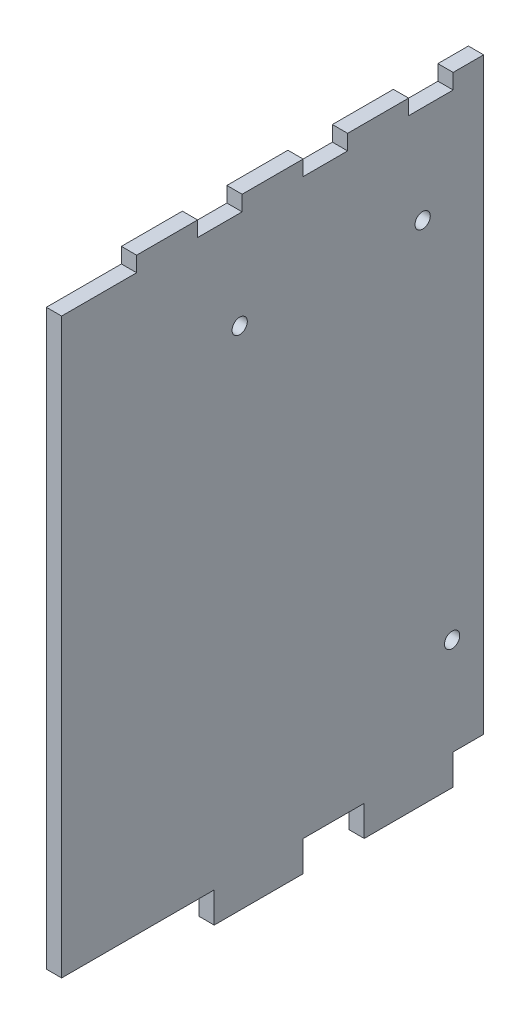
ISO-10303-21;
HEADER;
FILE_DESCRIPTION(('STEP AP214'),'2;1');
FILE_NAME('part.step','',(''),(''),'','','');
FILE_SCHEMA(('AUTOMOTIVE_DESIGN { 1 0 10303 214 1 1 1 1 }'));
ENDSEC;
DATA;
#1=APPLICATION_CONTEXT('core data for automotive mechanical design processes');
#2=APPLICATION_PROTOCOL_DEFINITION('international standard','automotive_design',2000,#1);
#3=PRODUCT_CONTEXT('',#1,'mechanical');
#4=PRODUCT('Part','Part','',(#3));
#5=PRODUCT_RELATED_PRODUCT_CATEGORY('part','',(#4));
#6=PRODUCT_DEFINITION_FORMATION('','',#4);
#7=PRODUCT_DEFINITION_CONTEXT('part definition',#1,'design');
#8=PRODUCT_DEFINITION('design','',#6,#7);
#9=PRODUCT_DEFINITION_SHAPE('','',#8);
#10=(LENGTH_UNIT() NAMED_UNIT(*) SI_UNIT(.MILLI.,.METRE.));
#11=(NAMED_UNIT(*) PLANE_ANGLE_UNIT() SI_UNIT($,.RADIAN.));
#12=(NAMED_UNIT(*) SI_UNIT($,.STERADIAN.) SOLID_ANGLE_UNIT());
#13=UNCERTAINTY_MEASURE_WITH_UNIT(LENGTH_MEASURE(1.E-05),#10,'distance_accuracy_value','');
#14=(GEOMETRIC_REPRESENTATION_CONTEXT(3) GLOBAL_UNCERTAINTY_ASSIGNED_CONTEXT((#13)) GLOBAL_UNIT_ASSIGNED_CONTEXT((#10,
#11,#12)) REPRESENTATION_CONTEXT('',''));
#15=CARTESIAN_POINT('',(0.,0.,0.));
#16=DIRECTION('',(0.,0.,1.));
#17=DIRECTION('',(1.,0.,0.));
#18=AXIS2_PLACEMENT_3D('',#15,#16,#17);
#19=CARTESIAN_POINT('',(3.175,119.38,0.));
#20=DIRECTION('',(0.,0.,-1.));
#21=DIRECTION('',(0.,1.,0.));
#22=AXIS2_PLACEMENT_3D('',#19,#20,#21);
#23=PLANE('',#22);
#24=DIRECTION('',(0.,-1.,0.));
#25=VECTOR('',#24,1.);
#26=CARTESIAN_POINT('',(0.,119.38,0.));
#27=LINE('',#26,#25);
#28=CARTESIAN_POINT('',(0.,119.38,0.));
#29=VERTEX_POINT('',#28);
#30=CARTESIAN_POINT('',(0.,0.,0.));
#31=VERTEX_POINT('',#30);
#32=EDGE_CURVE('E250',#29,#31,#27,.T.);
#33=ORIENTED_EDGE('',*,*,#32,.T.);
#34=DIRECTION('',(-1.,0.,0.));
#35=VECTOR('',#34,1.);
#36=CARTESIAN_POINT('',(3.175,0.,0.));
#37=LINE('',#36,#35);
#38=CARTESIAN_POINT('',(3.175,0.,0.));
#39=VERTEX_POINT('',#38);
#40=EDGE_CURVE('E11',#39,#31,#37,.T.);
#41=ORIENTED_EDGE('',*,*,#40,.F.);
#42=DIRECTION('',(0.,-1.,0.));
#43=VECTOR('',#42,1.);
#44=CARTESIAN_POINT('',(3.175,119.38,0.));
#45=LINE('',#44,#43);
#46=CARTESIAN_POINT('',(3.175,119.38,0.));
#47=VERTEX_POINT('',#46);
#48=EDGE_CURVE('E327',#47,#39,#45,.T.);
#49=ORIENTED_EDGE('',*,*,#48,.F.);
#50=DIRECTION('',(-1.,0.,0.));
#51=VECTOR('',#50,1.);
#52=CARTESIAN_POINT('',(3.175,119.38,0.));
#53=LINE('',#52,#51);
#54=EDGE_CURVE('E246',#47,#29,#53,.T.);
#55=ORIENTED_EDGE('',*,*,#54,.T.);
#56=EDGE_LOOP('',(#33,#41,#49,#55));
#57=FACE_BOUND('',#56,.T.);
#58=ADVANCED_FACE('F41',(#57),#23,.F.);
#59=CARTESIAN_POINT('',(3.175,0.,0.));
#60=DIRECTION('',(0.,1.,0.));
#61=DIRECTION('',(0.,0.,1.));
#62=AXIS2_PLACEMENT_3D('',#59,#60,#61);
#63=PLANE('',#62);
#64=DIRECTION('',(0.,0.,-1.));
#65=VECTOR('',#64,1.);
#66=CARTESIAN_POINT('',(0.,0.,0.));
#67=LINE('',#66,#65);
#68=CARTESIAN_POINT('',(0.,0.,-31.7754));
#69=VERTEX_POINT('',#68);
#70=EDGE_CURVE('E254',#31,#69,#67,.T.);
#71=ORIENTED_EDGE('',*,*,#70,.T.);
#72=DIRECTION('',(-1.,0.,0.));
#73=VECTOR('',#72,1.);
#74=CARTESIAN_POINT('',(3.175,0.,-31.7754));
#75=LINE('',#74,#73);
#76=CARTESIAN_POINT('',(3.175,0.,-31.7754));
#77=VERTEX_POINT('',#76);
#78=EDGE_CURVE('E50',#77,#69,#75,.T.);
#79=ORIENTED_EDGE('',*,*,#78,.F.);
#80=DIRECTION('',(0.,0.,-1.));
#81=VECTOR('',#80,1.);
#82=CARTESIAN_POINT('',(3.175,0.,0.));
#83=LINE('',#82,#81);
#84=EDGE_CURVE('E155',#39,#77,#83,.T.);
#85=ORIENTED_EDGE('',*,*,#84,.F.);
#86=ORIENTED_EDGE('',*,*,#40,.T.);
#87=EDGE_LOOP('',(#71,#79,#85,#86));
#88=FACE_BOUND('',#87,.T.);
#89=ADVANCED_FACE('F520',(#88),#63,.F.);
#90=CARTESIAN_POINT('',(3.175,0.,-31.7754));
#91=DIRECTION('',(0.,0.,-1.));
#92=DIRECTION('',(-1.,0.,0.));
#93=AXIS2_PLACEMENT_3D('',#90,#91,#92);
#94=PLANE('',#93);
#95=DIRECTION('',(0.,-1.,0.));
#96=VECTOR('',#95,1.);
#97=CARTESIAN_POINT('',(0.,0.,-31.7754));
#98=LINE('',#97,#96);
#99=CARTESIAN_POINT('',(0.,-6.35,-31.7754));
#100=VERTEX_POINT('',#99);
#101=EDGE_CURVE('E258',#69,#100,#98,.T.);
#102=ORIENTED_EDGE('',*,*,#101,.T.);
#103=DIRECTION('',(-1.,0.,0.));
#104=VECTOR('',#103,1.);
#105=CARTESIAN_POINT('',(3.175,-6.35,-31.7754));
#106=LINE('',#105,#104);
#107=CARTESIAN_POINT('',(3.175,-6.35,-31.7754));
#108=VERTEX_POINT('',#107);
#109=EDGE_CURVE('E410',#108,#100,#106,.T.);
#110=ORIENTED_EDGE('',*,*,#109,.F.);
#111=DIRECTION('',(0.,-1.,0.));
#112=VECTOR('',#111,1.);
#113=CARTESIAN_POINT('',(3.175,0.,-31.7754));
#114=LINE('',#113,#112);
#115=EDGE_CURVE('E420',#77,#108,#114,.T.);
#116=ORIENTED_EDGE('',*,*,#115,.F.);
#117=ORIENTED_EDGE('',*,*,#78,.T.);
#118=EDGE_LOOP('',(#102,#110,#116,#117));
#119=FACE_BOUND('',#118,.T.);
#120=ADVANCED_FACE('F418',(#119),#94,.F.);
#121=CARTESIAN_POINT('',(3.175,-6.35,-31.7754));
#122=DIRECTION('',(0.,1.,0.));
#123=DIRECTION('',(0.,0.,1.));
#124=AXIS2_PLACEMENT_3D('',#121,#122,#123);
#125=PLANE('',#124);
#126=DIRECTION('',(0.,0.,-1.));
#127=VECTOR('',#126,1.);
#128=CARTESIAN_POINT('',(0.,-6.35,-31.7754));
#129=LINE('',#128,#127);
#130=CARTESIAN_POINT('',(0.,-6.35,-50.2666));
#131=VERTEX_POINT('',#130);
#132=EDGE_CURVE('E261',#100,#131,#129,.T.);
#133=ORIENTED_EDGE('',*,*,#132,.T.);
#134=DIRECTION('',(-1.,0.,0.));
#135=VECTOR('',#134,1.);
#136=CARTESIAN_POINT('',(3.175,-6.35,-50.2666));
#137=LINE('',#136,#135);
#138=CARTESIAN_POINT('',(3.175,-6.35,-50.2666));
#139=VERTEX_POINT('',#138);
#140=EDGE_CURVE('E406',#139,#131,#137,.T.);
#141=ORIENTED_EDGE('',*,*,#140,.F.);
#142=DIRECTION('',(0.,0.,-1.));
#143=VECTOR('',#142,1.);
#144=CARTESIAN_POINT('',(3.175,-6.35,-31.7754));
#145=LINE('',#144,#143);
#146=EDGE_CURVE('E439',#108,#139,#145,.T.);
#147=ORIENTED_EDGE('',*,*,#146,.F.);
#148=ORIENTED_EDGE('',*,*,#109,.T.);
#149=EDGE_LOOP('',(#133,#141,#147,#148));
#150=FACE_BOUND('',#149,.T.);
#151=ADVANCED_FACE('F429',(#150),#125,.F.);
#152=CARTESIAN_POINT('',(3.175,0.,-50.2666));
#153=DIRECTION('',(0.,0.,1.));
#154=DIRECTION('',(1.,0.,0.));
#155=AXIS2_PLACEMENT_3D('',#152,#153,#154);
#156=PLANE('',#155);
#157=DIRECTION('',(0.,1.,0.));
#158=VECTOR('',#157,1.);
#159=CARTESIAN_POINT('',(0.,0.,-50.2666));
#160=LINE('',#159,#158);
#161=CARTESIAN_POINT('',(0.,0.,-50.2666));
#162=VERTEX_POINT('',#161);
#163=EDGE_CURVE('E264',#131,#162,#160,.T.);
#164=ORIENTED_EDGE('',*,*,#163,.T.);
#165=DIRECTION('',(-1.,0.,0.));
#166=VECTOR('',#165,1.);
#167=CARTESIAN_POINT('',(3.175,0.,-50.2666));
#168=LINE('',#167,#166);
#169=CARTESIAN_POINT('',(3.175,0.,-50.2666));
#170=VERTEX_POINT('',#169);
#171=EDGE_CURVE('E402',#170,#162,#168,.T.);
#172=ORIENTED_EDGE('',*,*,#171,.F.);
#173=DIRECTION('',(0.,1.,0.));
#174=VECTOR('',#173,1.);
#175=CARTESIAN_POINT('',(3.175,0.,-50.2666));
#176=LINE('',#175,#174);
#177=EDGE_CURVE('E435',#139,#170,#176,.T.);
#178=ORIENTED_EDGE('',*,*,#177,.F.);
#179=ORIENTED_EDGE('',*,*,#140,.T.);
#180=EDGE_LOOP('',(#164,#172,#178,#179));
#181=FACE_BOUND('',#180,.T.);
#182=ADVANCED_FACE('F433',(#181),#156,.F.);
#183=CARTESIAN_POINT('',(3.175,0.,-50.2666));
#184=DIRECTION('',(0.,1.,0.));
#185=DIRECTION('',(0.,0.,1.));
#186=AXIS2_PLACEMENT_3D('',#183,#184,#185);
#187=PLANE('',#186);
#188=DIRECTION('',(0.,0.,-1.));
#189=VECTOR('',#188,1.);
#190=CARTESIAN_POINT('',(0.,0.,-50.2666));
#191=LINE('',#190,#189);
#192=CARTESIAN_POINT('',(0.,0.,-63.0174));
#193=VERTEX_POINT('',#192);
#194=EDGE_CURVE('E267',#162,#193,#191,.T.);
#195=ORIENTED_EDGE('',*,*,#194,.T.);
#196=DIRECTION('',(-1.,0.,0.));
#197=VECTOR('',#196,1.);
#198=CARTESIAN_POINT('',(3.175,0.,-63.0174));
#199=LINE('',#198,#197);
#200=CARTESIAN_POINT('',(3.175,0.,-63.0174));
#201=VERTEX_POINT('',#200);
#202=EDGE_CURVE('E398',#201,#193,#199,.T.);
#203=ORIENTED_EDGE('',*,*,#202,.F.);
#204=DIRECTION('',(0.,0.,-1.));
#205=VECTOR('',#204,1.);
#206=CARTESIAN_POINT('',(3.175,0.,-50.2666));
#207=LINE('',#206,#205);
#208=EDGE_CURVE('E438',#170,#201,#207,.T.);
#209=ORIENTED_EDGE('',*,*,#208,.F.);
#210=ORIENTED_EDGE('',*,*,#171,.T.);
#211=EDGE_LOOP('',(#195,#203,#209,#210));
#212=FACE_BOUND('',#211,.T.);
#213=ADVANCED_FACE('F533',(#212),#187,.F.);
#214=CARTESIAN_POINT('',(3.175,0.,-63.0174));
#215=DIRECTION('',(0.,0.,-1.));
#216=DIRECTION('',(-1.,0.,0.));
#217=AXIS2_PLACEMENT_3D('',#214,#215,#216);
#218=PLANE('',#217);
#219=DIRECTION('',(0.,-1.,0.));
#220=VECTOR('',#219,1.);
#221=CARTESIAN_POINT('',(0.,0.,-63.0174));
#222=LINE('',#221,#220);
#223=CARTESIAN_POINT('',(0.,-6.35,-63.0174));
#224=VERTEX_POINT('',#223);
#225=EDGE_CURVE('E270',#193,#224,#222,.T.);
#226=ORIENTED_EDGE('',*,*,#225,.T.);
#227=DIRECTION('',(-1.,0.,0.));
#228=VECTOR('',#227,1.);
#229=CARTESIAN_POINT('',(3.175,-6.35,-63.0174));
#230=LINE('',#229,#228);
#231=CARTESIAN_POINT('',(3.175,-6.35,-63.0174));
#232=VERTEX_POINT('',#231);
#233=EDGE_CURVE('E394',#232,#224,#230,.T.);
#234=ORIENTED_EDGE('',*,*,#233,.F.);
#235=DIRECTION('',(0.,-1.,0.));
#236=VECTOR('',#235,1.);
#237=CARTESIAN_POINT('',(3.175,0.,-63.0174));
#238=LINE('',#237,#236);
#239=EDGE_CURVE('E443',#201,#232,#238,.T.);
#240=ORIENTED_EDGE('',*,*,#239,.F.);
#241=ORIENTED_EDGE('',*,*,#202,.T.);
#242=EDGE_LOOP('',(#226,#234,#240,#241));
#243=FACE_BOUND('',#242,.T.);
#244=ADVANCED_FACE('F536',(#243),#218,.F.);
#245=CARTESIAN_POINT('',(3.175,-6.35,-63.0174));
#246=DIRECTION('',(0.,1.,0.));
#247=DIRECTION('',(0.,0.,1.));
#248=AXIS2_PLACEMENT_3D('',#245,#246,#247);
#249=PLANE('',#248);
#250=DIRECTION('',(0.,0.,-1.));
#251=VECTOR('',#250,1.);
#252=CARTESIAN_POINT('',(0.,-6.35,-63.0174));
#253=LINE('',#252,#251);
#254=CARTESIAN_POINT('',(0.,-6.35,-81.5086));
#255=VERTEX_POINT('',#254);
#256=EDGE_CURVE('E273',#224,#255,#253,.T.);
#257=ORIENTED_EDGE('',*,*,#256,.T.);
#258=DIRECTION('',(-1.,0.,0.));
#259=VECTOR('',#258,1.);
#260=CARTESIAN_POINT('',(3.175,-6.35,-81.5086));
#261=LINE('',#260,#259);
#262=CARTESIAN_POINT('',(3.175,-6.35,-81.5086));
#263=VERTEX_POINT('',#262);
#264=EDGE_CURVE('E390',#263,#255,#261,.T.);
#265=ORIENTED_EDGE('',*,*,#264,.F.);
#266=DIRECTION('',(0.,0.,-1.));
#267=VECTOR('',#266,1.);
#268=CARTESIAN_POINT('',(3.175,-6.35,-63.0174));
#269=LINE('',#268,#267);
#270=EDGE_CURVE('E450',#232,#263,#269,.T.);
#271=ORIENTED_EDGE('',*,*,#270,.F.);
#272=ORIENTED_EDGE('',*,*,#233,.T.);
#273=EDGE_LOOP('',(#257,#265,#271,#272));
#274=FACE_BOUND('',#273,.T.);
#275=ADVANCED_FACE('F540',(#274),#249,.F.);
#276=CARTESIAN_POINT('',(3.175,0.,-81.5086));
#277=DIRECTION('',(0.,0.,1.));
#278=DIRECTION('',(1.,0.,0.));
#279=AXIS2_PLACEMENT_3D('',#276,#277,#278);
#280=PLANE('',#279);
#281=DIRECTION('',(0.,1.,0.));
#282=VECTOR('',#281,1.);
#283=CARTESIAN_POINT('',(0.,0.,-81.5086));
#284=LINE('',#283,#282);
#285=CARTESIAN_POINT('',(0.,0.,-81.5086));
#286=VERTEX_POINT('',#285);
#287=EDGE_CURVE('E276',#255,#286,#284,.T.);
#288=ORIENTED_EDGE('',*,*,#287,.T.);
#289=DIRECTION('',(-1.,0.,0.));
#290=VECTOR('',#289,1.);
#291=CARTESIAN_POINT('',(3.175,0.,-81.5086));
#292=LINE('',#291,#290);
#293=CARTESIAN_POINT('',(3.175,0.,-81.5086));
#294=VERTEX_POINT('',#293);
#295=EDGE_CURVE('E386',#294,#286,#292,.T.);
#296=ORIENTED_EDGE('',*,*,#295,.F.);
#297=DIRECTION('',(0.,1.,0.));
#298=VECTOR('',#297,1.);
#299=CARTESIAN_POINT('',(3.175,0.,-81.5086));
#300=LINE('',#299,#298);
#301=EDGE_CURVE('E453',#263,#294,#300,.T.);
#302=ORIENTED_EDGE('',*,*,#301,.F.);
#303=ORIENTED_EDGE('',*,*,#264,.T.);
#304=EDGE_LOOP('',(#288,#296,#302,#303));
#305=FACE_BOUND('',#304,.T.);
#306=ADVANCED_FACE('F544',(#305),#280,.F.);
#307=CARTESIAN_POINT('',(3.175,0.,-81.5086));
#308=DIRECTION('',(0.,1.,0.));
#309=DIRECTION('',(0.,0.,1.));
#310=AXIS2_PLACEMENT_3D('',#307,#308,#309);
#311=PLANE('',#310);
#312=DIRECTION('',(0.,0.,-1.));
#313=VECTOR('',#312,1.);
#314=CARTESIAN_POINT('',(0.,0.,-81.5086));
#315=LINE('',#314,#313);
#316=CARTESIAN_POINT('',(0.,0.,-87.884));
#317=VERTEX_POINT('',#316);
#318=EDGE_CURVE('E279',#286,#317,#315,.T.);
#319=ORIENTED_EDGE('',*,*,#318,.T.);
#320=DIRECTION('',(-1.,0.,0.));
#321=VECTOR('',#320,1.);
#322=CARTESIAN_POINT('',(3.175,0.,-87.884));
#323=LINE('',#322,#321);
#324=CARTESIAN_POINT('',(3.175,0.,-87.884));
#325=VERTEX_POINT('',#324);
#326=EDGE_CURVE('E382',#325,#317,#323,.T.);
#327=ORIENTED_EDGE('',*,*,#326,.F.);
#328=DIRECTION('',(0.,0.,-1.));
#329=VECTOR('',#328,1.);
#330=CARTESIAN_POINT('',(3.175,0.,-81.5086));
#331=LINE('',#330,#329);
#332=EDGE_CURVE('E456',#294,#325,#331,.T.);
#333=ORIENTED_EDGE('',*,*,#332,.F.);
#334=ORIENTED_EDGE('',*,*,#295,.T.);
#335=EDGE_LOOP('',(#319,#327,#333,#334));
#336=FACE_BOUND('',#335,.T.);
#337=ADVANCED_FACE('F548',(#336),#311,.F.);
#338=CARTESIAN_POINT('',(3.175,122.555,-87.884));
#339=DIRECTION('',(0.,0.,1.));
#340=DIRECTION('',(0.,-1.,0.));
#341=AXIS2_PLACEMENT_3D('',#338,#339,#340);
#342=PLANE('',#341);
#343=DIRECTION('',(0.,1.,0.));
#344=VECTOR('',#343,1.);
#345=CARTESIAN_POINT('',(0.,122.555,-87.884));
#346=LINE('',#345,#344);
#347=CARTESIAN_POINT('',(0.,122.555,-87.884));
#348=VERTEX_POINT('',#347);
#349=EDGE_CURVE('E282',#317,#348,#346,.T.);
#350=ORIENTED_EDGE('',*,*,#349,.T.);
#351=DIRECTION('',(-1.,0.,0.));
#352=VECTOR('',#351,1.);
#353=CARTESIAN_POINT('',(3.175,122.555,-87.884));
#354=LINE('',#353,#352);
#355=CARTESIAN_POINT('',(3.175,122.555,-87.884));
#356=VERTEX_POINT('',#355);
#357=EDGE_CURVE('E378',#356,#348,#354,.T.);
#358=ORIENTED_EDGE('',*,*,#357,.F.);
#359=DIRECTION('',(0.,1.,0.));
#360=VECTOR('',#359,1.);
#361=CARTESIAN_POINT('',(3.175,122.555,-87.884));
#362=LINE('',#361,#360);
#363=EDGE_CURVE('E459',#325,#356,#362,.T.);
#364=ORIENTED_EDGE('',*,*,#363,.F.);
#365=ORIENTED_EDGE('',*,*,#326,.T.);
#366=EDGE_LOOP('',(#350,#358,#364,#365));
#367=FACE_BOUND('',#366,.T.);
#368=ADVANCED_FACE('F552',(#367),#342,.F.);
#369=CARTESIAN_POINT('',(3.175,122.555,-87.884));
#370=DIRECTION('',(0.,-1.,0.));
#371=DIRECTION('',(0.,0.,-1.));
#372=AXIS2_PLACEMENT_3D('',#369,#370,#371);
#373=PLANE('',#372);
#374=DIRECTION('',(0.,0.,1.));
#375=VECTOR('',#374,1.);
#376=CARTESIAN_POINT('',(0.,122.555,-87.884));
#377=LINE('',#376,#375);
#378=CARTESIAN_POINT('',(0.,122.555,-81.534));
#379=VERTEX_POINT('',#378);
#380=EDGE_CURVE('E285',#348,#379,#377,.T.);
#381=ORIENTED_EDGE('',*,*,#380,.T.);
#382=DIRECTION('',(-1.,0.,0.));
#383=VECTOR('',#382,1.);
#384=CARTESIAN_POINT('',(3.175,122.555,-81.534));
#385=LINE('',#384,#383);
#386=CARTESIAN_POINT('',(3.175,122.555,-81.534));
#387=VERTEX_POINT('',#386);
#388=EDGE_CURVE('E374',#387,#379,#385,.T.);
#389=ORIENTED_EDGE('',*,*,#388,.F.);
#390=DIRECTION('',(0.,0.,1.));
#391=VECTOR('',#390,1.);
#392=CARTESIAN_POINT('',(3.175,122.555,-87.884));
#393=LINE('',#392,#391);
#394=EDGE_CURVE('E462',#356,#387,#393,.T.);
#395=ORIENTED_EDGE('',*,*,#394,.F.);
#396=ORIENTED_EDGE('',*,*,#357,.T.);
#397=EDGE_LOOP('',(#381,#389,#395,#396));
#398=FACE_BOUND('',#397,.T.);
#399=ADVANCED_FACE('F556',(#398),#373,.F.);
#400=CARTESIAN_POINT('',(3.175,119.38,-81.534));
#401=DIRECTION('',(0.,0.,-1.));
#402=DIRECTION('',(-1.,0.,0.));
#403=AXIS2_PLACEMENT_3D('',#400,#401,#402);
#404=PLANE('',#403);
#405=DIRECTION('',(0.,-1.,0.));
#406=VECTOR('',#405,1.);
#407=CARTESIAN_POINT('',(0.,119.38,-81.534));
#408=LINE('',#407,#406);
#409=CARTESIAN_POINT('',(0.,119.38,-81.534));
#410=VERTEX_POINT('',#409);
#411=EDGE_CURVE('E288',#379,#410,#408,.T.);
#412=ORIENTED_EDGE('',*,*,#411,.T.);
#413=DIRECTION('',(-1.,0.,0.));
#414=VECTOR('',#413,1.);
#415=CARTESIAN_POINT('',(3.175,119.38,-81.534));
#416=LINE('',#415,#414);
#417=CARTESIAN_POINT('',(3.175,119.38,-81.534));
#418=VERTEX_POINT('',#417);
#419=EDGE_CURVE('E370',#418,#410,#416,.T.);
#420=ORIENTED_EDGE('',*,*,#419,.F.);
#421=DIRECTION('',(0.,-1.,0.));
#422=VECTOR('',#421,1.);
#423=CARTESIAN_POINT('',(3.175,119.38,-81.534));
#424=LINE('',#423,#422);
#425=EDGE_CURVE('E465',#387,#418,#424,.T.);
#426=ORIENTED_EDGE('',*,*,#425,.F.);
#427=ORIENTED_EDGE('',*,*,#388,.T.);
#428=EDGE_LOOP('',(#412,#420,#426,#427));
#429=FACE_BOUND('',#428,.T.);
#430=ADVANCED_FACE('F560',(#429),#404,.F.);
#431=CARTESIAN_POINT('',(3.175,119.38,-72.263));
#432=DIRECTION('',(0.,-1.,0.));
#433=DIRECTION('',(0.,0.,-1.));
#434=AXIS2_PLACEMENT_3D('',#431,#432,#433);
#435=PLANE('',#434);
#436=DIRECTION('',(0.,0.,1.));
#437=VECTOR('',#436,1.);
#438=CARTESIAN_POINT('',(0.,119.38,-72.263));
#439=LINE('',#438,#437);
#440=CARTESIAN_POINT('',(0.,119.38,-72.263));
#441=VERTEX_POINT('',#440);
#442=EDGE_CURVE('E291',#410,#441,#439,.T.);
#443=ORIENTED_EDGE('',*,*,#442,.T.);
#444=DIRECTION('',(-1.,0.,0.));
#445=VECTOR('',#444,1.);
#446=CARTESIAN_POINT('',(3.175,119.38,-72.263));
#447=LINE('',#446,#445);
#448=CARTESIAN_POINT('',(3.175,119.38,-72.263));
#449=VERTEX_POINT('',#448);
#450=EDGE_CURVE('E366',#449,#441,#447,.T.);
#451=ORIENTED_EDGE('',*,*,#450,.F.);
#452=DIRECTION('',(0.,0.,1.));
#453=VECTOR('',#452,1.);
#454=CARTESIAN_POINT('',(3.175,119.38,-72.263));
#455=LINE('',#454,#453);
#456=EDGE_CURVE('E468',#418,#449,#455,.T.);
#457=ORIENTED_EDGE('',*,*,#456,.F.);
#458=ORIENTED_EDGE('',*,*,#419,.T.);
#459=EDGE_LOOP('',(#443,#451,#457,#458));
#460=FACE_BOUND('',#459,.T.);
#461=ADVANCED_FACE('F564',(#460),#435,.F.);
#462=CARTESIAN_POINT('',(3.175,119.38,-72.263));
#463=DIRECTION('',(0.,0.,1.));
#464=DIRECTION('',(1.,0.,0.));
#465=AXIS2_PLACEMENT_3D('',#462,#463,#464);
#466=PLANE('',#465);
#467=DIRECTION('',(0.,1.,0.));
#468=VECTOR('',#467,1.);
#469=CARTESIAN_POINT('',(0.,119.38,-72.263));
#470=LINE('',#469,#468);
#471=CARTESIAN_POINT('',(0.,122.555,-72.263));
#472=VERTEX_POINT('',#471);
#473=EDGE_CURVE('E294',#441,#472,#470,.T.);
#474=ORIENTED_EDGE('',*,*,#473,.T.);
#475=DIRECTION('',(-1.,0.,0.));
#476=VECTOR('',#475,1.);
#477=CARTESIAN_POINT('',(3.175,122.555,-72.263));
#478=LINE('',#477,#476);
#479=CARTESIAN_POINT('',(3.175,122.555,-72.263));
#480=VERTEX_POINT('',#479);
#481=EDGE_CURVE('E362',#480,#472,#478,.T.);
#482=ORIENTED_EDGE('',*,*,#481,.F.);
#483=DIRECTION('',(0.,1.,0.));
#484=VECTOR('',#483,1.);
#485=CARTESIAN_POINT('',(3.175,119.38,-72.263));
#486=LINE('',#485,#484);
#487=EDGE_CURVE('E471',#449,#480,#486,.T.);
#488=ORIENTED_EDGE('',*,*,#487,.F.);
#489=ORIENTED_EDGE('',*,*,#450,.T.);
#490=EDGE_LOOP('',(#474,#482,#488,#489));
#491=FACE_BOUND('',#490,.T.);
#492=ADVANCED_FACE('F568',(#491),#466,.F.);
#493=CARTESIAN_POINT('',(3.175,122.555,-59.563));
#494=DIRECTION('',(0.,-1.,0.));
#495=DIRECTION('',(0.,0.,-1.));
#496=AXIS2_PLACEMENT_3D('',#493,#494,#495);
#497=PLANE('',#496);
#498=DIRECTION('',(0.,0.,1.));
#499=VECTOR('',#498,1.);
#500=CARTESIAN_POINT('',(0.,122.555,-59.563));
#501=LINE('',#500,#499);
#502=CARTESIAN_POINT('',(0.,122.555,-59.563));
#503=VERTEX_POINT('',#502);
#504=EDGE_CURVE('E297',#472,#503,#501,.T.);
#505=ORIENTED_EDGE('',*,*,#504,.T.);
#506=DIRECTION('',(-1.,0.,0.));
#507=VECTOR('',#506,1.);
#508=CARTESIAN_POINT('',(3.175,122.555,-59.563));
#509=LINE('',#508,#507);
#510=CARTESIAN_POINT('',(3.175,122.555,-59.563));
#511=VERTEX_POINT('',#510);
#512=EDGE_CURVE('E358',#511,#503,#509,.T.);
#513=ORIENTED_EDGE('',*,*,#512,.F.);
#514=DIRECTION('',(0.,0.,1.));
#515=VECTOR('',#514,1.);
#516=CARTESIAN_POINT('',(3.175,122.555,-59.563));
#517=LINE('',#516,#515);
#518=EDGE_CURVE('E474',#480,#511,#517,.T.);
#519=ORIENTED_EDGE('',*,*,#518,.F.);
#520=ORIENTED_EDGE('',*,*,#481,.T.);
#521=EDGE_LOOP('',(#505,#513,#519,#520));
#522=FACE_BOUND('',#521,.T.);
#523=ADVANCED_FACE('F572',(#522),#497,.F.);
#524=CARTESIAN_POINT('',(3.175,119.38,-59.563));
#525=DIRECTION('',(0.,0.,-1.));
#526=DIRECTION('',(0.,1.,0.));
#527=AXIS2_PLACEMENT_3D('',#524,#525,#526);
#528=PLANE('',#527);
#529=DIRECTION('',(0.,-1.,0.));
#530=VECTOR('',#529,1.);
#531=CARTESIAN_POINT('',(0.,119.38,-59.563));
#532=LINE('',#531,#530);
#533=CARTESIAN_POINT('',(0.,119.38,-59.563));
#534=VERTEX_POINT('',#533);
#535=EDGE_CURVE('E300',#503,#534,#532,.T.);
#536=ORIENTED_EDGE('',*,*,#535,.T.);
#537=DIRECTION('',(-1.,0.,0.));
#538=VECTOR('',#537,1.);
#539=CARTESIAN_POINT('',(3.175,119.38,-59.563));
#540=LINE('',#539,#538);
#541=CARTESIAN_POINT('',(3.175,119.38,-59.563));
#542=VERTEX_POINT('',#541);
#543=EDGE_CURVE('E354',#542,#534,#540,.T.);
#544=ORIENTED_EDGE('',*,*,#543,.F.);
#545=DIRECTION('',(0.,-1.,0.));
#546=VECTOR('',#545,1.);
#547=CARTESIAN_POINT('',(3.175,119.38,-59.563));
#548=LINE('',#547,#546);
#549=EDGE_CURVE('E477',#511,#542,#548,.T.);
#550=ORIENTED_EDGE('',*,*,#549,.F.);
#551=ORIENTED_EDGE('',*,*,#512,.T.);
#552=EDGE_LOOP('',(#536,#544,#550,#551));
#553=FACE_BOUND('',#552,.T.);
#554=ADVANCED_FACE('F576',(#553),#528,.F.);
#555=CARTESIAN_POINT('',(3.175,119.38,-50.292));
#556=DIRECTION('',(0.,-1.,0.));
#557=DIRECTION('',(0.,0.,-1.));
#558=AXIS2_PLACEMENT_3D('',#555,#556,#557);
#559=PLANE('',#558);
#560=DIRECTION('',(0.,0.,1.));
#561=VECTOR('',#560,1.);
#562=CARTESIAN_POINT('',(0.,119.38,-50.292));
#563=LINE('',#562,#561);
#564=CARTESIAN_POINT('',(0.,119.38,-50.292));
#565=VERTEX_POINT('',#564);
#566=EDGE_CURVE('E303',#534,#565,#563,.T.);
#567=ORIENTED_EDGE('',*,*,#566,.T.);
#568=DIRECTION('',(-1.,0.,0.));
#569=VECTOR('',#568,1.);
#570=CARTESIAN_POINT('',(3.175,119.38,-50.292));
#571=LINE('',#570,#569);
#572=CARTESIAN_POINT('',(3.175,119.38,-50.292));
#573=VERTEX_POINT('',#572);
#574=EDGE_CURVE('E350',#573,#565,#571,.T.);
#575=ORIENTED_EDGE('',*,*,#574,.F.);
#576=DIRECTION('',(0.,0.,1.));
#577=VECTOR('',#576,1.);
#578=CARTESIAN_POINT('',(3.175,119.38,-50.292));
#579=LINE('',#578,#577);
#580=EDGE_CURVE('E480',#542,#573,#579,.T.);
#581=ORIENTED_EDGE('',*,*,#580,.F.);
#582=ORIENTED_EDGE('',*,*,#543,.T.);
#583=EDGE_LOOP('',(#567,#575,#581,#582));
#584=FACE_BOUND('',#583,.T.);
#585=ADVANCED_FACE('F580',(#584),#559,.F.);
#586=CARTESIAN_POINT('',(3.175,119.38,-50.292));
#587=DIRECTION('',(0.,0.,1.));
#588=DIRECTION('',(1.,0.,0.));
#589=AXIS2_PLACEMENT_3D('',#586,#587,#588);
#590=PLANE('',#589);
#591=DIRECTION('',(0.,1.,0.));
#592=VECTOR('',#591,1.);
#593=CARTESIAN_POINT('',(0.,119.38,-50.292));
#594=LINE('',#593,#592);
#595=CARTESIAN_POINT('',(0.,122.555,-50.292));
#596=VERTEX_POINT('',#595);
#597=EDGE_CURVE('E306',#565,#596,#594,.T.);
#598=ORIENTED_EDGE('',*,*,#597,.T.);
#599=DIRECTION('',(-1.,0.,0.));
#600=VECTOR('',#599,1.);
#601=CARTESIAN_POINT('',(3.175,122.555,-50.292));
#602=LINE('',#601,#600);
#603=CARTESIAN_POINT('',(3.175,122.555,-50.292));
#604=VERTEX_POINT('',#603);
#605=EDGE_CURVE('E346',#604,#596,#602,.T.);
#606=ORIENTED_EDGE('',*,*,#605,.F.);
#607=DIRECTION('',(0.,1.,0.));
#608=VECTOR('',#607,1.);
#609=CARTESIAN_POINT('',(3.175,119.38,-50.292));
#610=LINE('',#609,#608);
#611=EDGE_CURVE('E483',#573,#604,#610,.T.);
#612=ORIENTED_EDGE('',*,*,#611,.F.);
#613=ORIENTED_EDGE('',*,*,#574,.T.);
#614=EDGE_LOOP('',(#598,#606,#612,#613));
#615=FACE_BOUND('',#614,.T.);
#616=ADVANCED_FACE('F584',(#615),#590,.F.);
#617=CARTESIAN_POINT('',(3.175,122.555,-37.592));
#618=DIRECTION('',(0.,-1.,0.));
#619=DIRECTION('',(0.,0.,-1.));
#620=AXIS2_PLACEMENT_3D('',#617,#618,#619);
#621=PLANE('',#620);
#622=DIRECTION('',(0.,0.,1.));
#623=VECTOR('',#622,1.);
#624=CARTESIAN_POINT('',(0.,122.555,-37.592));
#625=LINE('',#624,#623);
#626=CARTESIAN_POINT('',(0.,122.555,-37.592));
#627=VERTEX_POINT('',#626);
#628=EDGE_CURVE('E309',#596,#627,#625,.T.);
#629=ORIENTED_EDGE('',*,*,#628,.T.);
#630=DIRECTION('',(-1.,0.,0.));
#631=VECTOR('',#630,1.);
#632=CARTESIAN_POINT('',(3.175,122.555,-37.592));
#633=LINE('',#632,#631);
#634=CARTESIAN_POINT('',(3.175,122.555,-37.592));
#635=VERTEX_POINT('',#634);
#636=EDGE_CURVE('E342',#635,#627,#633,.T.);
#637=ORIENTED_EDGE('',*,*,#636,.F.);
#638=DIRECTION('',(0.,0.,1.));
#639=VECTOR('',#638,1.);
#640=CARTESIAN_POINT('',(3.175,122.555,-37.592));
#641=LINE('',#640,#639);
#642=EDGE_CURVE('E486',#604,#635,#641,.T.);
#643=ORIENTED_EDGE('',*,*,#642,.F.);
#644=ORIENTED_EDGE('',*,*,#605,.T.);
#645=EDGE_LOOP('',(#629,#637,#643,#644));
#646=FACE_BOUND('',#645,.T.);
#647=ADVANCED_FACE('F588',(#646),#621,.F.);
#648=CARTESIAN_POINT('',(3.175,119.38,-37.592));
#649=DIRECTION('',(0.,0.,-1.));
#650=DIRECTION('',(-1.,0.,0.));
#651=AXIS2_PLACEMENT_3D('',#648,#649,#650);
#652=PLANE('',#651);
#653=DIRECTION('',(0.,-1.,0.));
#654=VECTOR('',#653,1.);
#655=CARTESIAN_POINT('',(0.,119.38,-37.592));
#656=LINE('',#655,#654);
#657=CARTESIAN_POINT('',(0.,119.38,-37.592));
#658=VERTEX_POINT('',#657);
#659=EDGE_CURVE('E312',#627,#658,#656,.T.);
#660=ORIENTED_EDGE('',*,*,#659,.T.);
#661=DIRECTION('',(-1.,0.,0.));
#662=VECTOR('',#661,1.);
#663=CARTESIAN_POINT('',(3.175,119.38,-37.592));
#664=LINE('',#663,#662);
#665=CARTESIAN_POINT('',(3.175,119.38,-37.592));
#666=VERTEX_POINT('',#665);
#667=EDGE_CURVE('E338',#666,#658,#664,.T.);
#668=ORIENTED_EDGE('',*,*,#667,.F.);
#669=DIRECTION('',(0.,-1.,0.));
#670=VECTOR('',#669,1.);
#671=CARTESIAN_POINT('',(3.175,119.38,-37.592));
#672=LINE('',#671,#670);
#673=EDGE_CURVE('E489',#635,#666,#672,.T.);
#674=ORIENTED_EDGE('',*,*,#673,.F.);
#675=ORIENTED_EDGE('',*,*,#636,.T.);
#676=EDGE_LOOP('',(#660,#668,#674,#675));
#677=FACE_BOUND('',#676,.T.);
#678=ADVANCED_FACE('F592',(#677),#652,.F.);
#679=CARTESIAN_POINT('',(3.175,119.38,-28.321));
#680=DIRECTION('',(0.,-1.,0.));
#681=DIRECTION('',(0.,0.,-1.));
#682=AXIS2_PLACEMENT_3D('',#679,#680,#681);
#683=PLANE('',#682);
#684=DIRECTION('',(0.,0.,1.));
#685=VECTOR('',#684,1.);
#686=CARTESIAN_POINT('',(0.,119.38,-28.321));
#687=LINE('',#686,#685);
#688=CARTESIAN_POINT('',(0.,119.38,-28.321));
#689=VERTEX_POINT('',#688);
#690=EDGE_CURVE('E315',#658,#689,#687,.T.);
#691=ORIENTED_EDGE('',*,*,#690,.T.);
#692=DIRECTION('',(-1.,0.,0.));
#693=VECTOR('',#692,1.);
#694=CARTESIAN_POINT('',(3.175,119.38,-28.321));
#695=LINE('',#694,#693);
#696=CARTESIAN_POINT('',(3.175,119.38,-28.321));
#697=VERTEX_POINT('',#696);
#698=EDGE_CURVE('E334',#697,#689,#695,.T.);
#699=ORIENTED_EDGE('',*,*,#698,.F.);
#700=DIRECTION('',(0.,0.,1.));
#701=VECTOR('',#700,1.);
#702=CARTESIAN_POINT('',(3.175,119.38,-28.321));
#703=LINE('',#702,#701);
#704=EDGE_CURVE('E492',#666,#697,#703,.T.);
#705=ORIENTED_EDGE('',*,*,#704,.F.);
#706=ORIENTED_EDGE('',*,*,#667,.T.);
#707=EDGE_LOOP('',(#691,#699,#705,#706));
#708=FACE_BOUND('',#707,.T.);
#709=ADVANCED_FACE('F500',(#708),#683,.F.);
#710=CARTESIAN_POINT('',(3.175,119.38,-28.321));
#711=DIRECTION('',(0.,0.,1.));
#712=DIRECTION('',(1.,0.,0.));
#713=AXIS2_PLACEMENT_3D('',#710,#711,#712);
#714=PLANE('',#713);
#715=DIRECTION('',(0.,1.,0.));
#716=VECTOR('',#715,1.);
#717=CARTESIAN_POINT('',(0.,119.38,-28.321));
#718=LINE('',#717,#716);
#719=CARTESIAN_POINT('',(0.,122.555,-28.321));
#720=VERTEX_POINT('',#719);
#721=EDGE_CURVE('E318',#689,#720,#718,.T.);
#722=ORIENTED_EDGE('',*,*,#721,.T.);
#723=DIRECTION('',(-1.,0.,0.));
#724=VECTOR('',#723,1.);
#725=CARTESIAN_POINT('',(3.175,122.555,-28.321));
#726=LINE('',#725,#724);
#727=CARTESIAN_POINT('',(3.175,122.555,-28.321));
#728=VERTEX_POINT('',#727);
#729=EDGE_CURVE('E239',#728,#720,#726,.T.);
#730=ORIENTED_EDGE('',*,*,#729,.F.);
#731=DIRECTION('',(0.,1.,0.));
#732=VECTOR('',#731,1.);
#733=CARTESIAN_POINT('',(3.175,119.38,-28.321));
#734=LINE('',#733,#732);
#735=EDGE_CURVE('E228',#697,#728,#734,.T.);
#736=ORIENTED_EDGE('',*,*,#735,.F.);
#737=ORIENTED_EDGE('',*,*,#698,.T.);
#738=EDGE_LOOP('',(#722,#730,#736,#737));
#739=FACE_BOUND('',#738,.T.);
#740=ADVANCED_FACE('F504',(#739),#714,.F.);
#741=CARTESIAN_POINT('',(3.175,122.555,-15.621));
#742=DIRECTION('',(0.,-1.,0.));
#743=DIRECTION('',(0.,0.,-1.));
#744=AXIS2_PLACEMENT_3D('',#741,#742,#743);
#745=PLANE('',#744);
#746=DIRECTION('',(0.,0.,1.));
#747=VECTOR('',#746,1.);
#748=CARTESIAN_POINT('',(0.,122.555,-15.621));
#749=LINE('',#748,#747);
#750=CARTESIAN_POINT('',(0.,122.555,-15.621));
#751=VERTEX_POINT('',#750);
#752=EDGE_CURVE('E237',#720,#751,#749,.T.);
#753=ORIENTED_EDGE('',*,*,#752,.T.);
#754=DIRECTION('',(-1.,0.,0.));
#755=VECTOR('',#754,1.);
#756=CARTESIAN_POINT('',(3.175,122.555,-15.621));
#757=LINE('',#756,#755);
#758=CARTESIAN_POINT('',(3.175,122.555,-15.621));
#759=VERTEX_POINT('',#758);
#760=EDGE_CURVE('E234',#759,#751,#757,.T.);
#761=ORIENTED_EDGE('',*,*,#760,.F.);
#762=DIRECTION('',(0.,0.,1.));
#763=VECTOR('',#762,1.);
#764=CARTESIAN_POINT('',(3.175,122.555,-15.621));
#765=LINE('',#764,#763);
#766=EDGE_CURVE('E222',#728,#759,#765,.T.);
#767=ORIENTED_EDGE('',*,*,#766,.F.);
#768=ORIENTED_EDGE('',*,*,#729,.T.);
#769=EDGE_LOOP('',(#753,#761,#767,#768));
#770=FACE_BOUND('',#769,.T.);
#771=ADVANCED_FACE('F235',(#770),#745,.F.);
#772=CARTESIAN_POINT('',(3.175,119.38,-15.621));
#773=DIRECTION('',(0.,0.,-1.));
#774=DIRECTION('',(0.,1.,0.));
#775=AXIS2_PLACEMENT_3D('',#772,#773,#774);
#776=PLANE('',#775);
#777=DIRECTION('',(0.,-1.,0.));
#778=VECTOR('',#777,1.);
#779=CARTESIAN_POINT('',(0.,119.38,-15.621));
#780=LINE('',#779,#778);
#781=CARTESIAN_POINT('',(0.,119.38,-15.621));
#782=VERTEX_POINT('',#781);
#783=EDGE_CURVE('E141',#751,#782,#780,.T.);
#784=ORIENTED_EDGE('',*,*,#783,.T.);
#785=DIRECTION('',(-1.,0.,0.));
#786=VECTOR('',#785,1.);
#787=CARTESIAN_POINT('',(3.175,119.38,-15.621));
#788=LINE('',#787,#786);
#789=CARTESIAN_POINT('',(3.175,119.38,-15.621));
#790=VERTEX_POINT('',#789);
#791=EDGE_CURVE('E240',#790,#782,#788,.T.);
#792=ORIENTED_EDGE('',*,*,#791,.F.);
#793=DIRECTION('',(0.,-1.,0.));
#794=VECTOR('',#793,1.);
#795=CARTESIAN_POINT('',(3.175,119.38,-15.621));
#796=LINE('',#795,#794);
#797=EDGE_CURVE('E226',#759,#790,#796,.T.);
#798=ORIENTED_EDGE('',*,*,#797,.F.);
#799=ORIENTED_EDGE('',*,*,#760,.T.);
#800=EDGE_LOOP('',(#784,#792,#798,#799));
#801=FACE_BOUND('',#800,.T.);
#802=ADVANCED_FACE('F242',(#801),#776,.F.);
#803=CARTESIAN_POINT('',(3.175,119.38,0.));
#804=DIRECTION('',(0.,-1.,0.));
#805=DIRECTION('',(0.,0.,-1.));
#806=AXIS2_PLACEMENT_3D('',#803,#804,#805);
#807=PLANE('',#806);
#808=DIRECTION('',(0.,0.,1.));
#809=VECTOR('',#808,1.);
#810=CARTESIAN_POINT('',(0.,119.38,0.));
#811=LINE('',#810,#809);
#812=EDGE_CURVE('E147',#782,#29,#811,.T.);
#813=ORIENTED_EDGE('',*,*,#812,.T.);
#814=ORIENTED_EDGE('',*,*,#54,.F.);
#815=DIRECTION('',(0.,0.,1.));
#816=VECTOR('',#815,1.);
#817=CARTESIAN_POINT('',(3.175,119.38,0.));
#818=LINE('',#817,#816);
#819=EDGE_CURVE('E58',#790,#47,#818,.T.);
#820=ORIENTED_EDGE('',*,*,#819,.F.);
#821=ORIENTED_EDGE('',*,*,#791,.T.);
#822=EDGE_LOOP('',(#813,#814,#820,#821));
#823=FACE_BOUND('',#822,.T.);
#824=ADVANCED_FACE('F508',(#823),#807,.F.);
#825=CARTESIAN_POINT('',(3.175,0.,0.));
#826=DIRECTION('',(1.,0.,0.));
#827=DIRECTION('',(0.,0.,-1.));
#828=AXIS2_PLACEMENT_3D('',#825,#826,#827);
#829=PLANE('',#828);
#830=CARTESIAN_POINT('',(3.175,20.32,-81.3199736343063));
#831=DIRECTION('',(-1.,0.,0.));
#832=DIRECTION('',(0.,0.,1.));
#833=AXIS2_PLACEMENT_3D('',#830,#831,#832);
#834=CIRCLE('',#833,1.5875);
#835=CARTESIAN_POINT('',(3.175,20.32,-79.7324736343063));
#836=VERTEX_POINT('',#835);
#837=EDGE_CURVE('E665',#836,#836,#834,.T.);
#838=ORIENTED_EDGE('',*,*,#837,.T.);
#839=EDGE_LOOP('',(#838));
#840=FACE_BOUND('',#839,.T.);
#841=CARTESIAN_POINT('',(3.175,99.06,-37.084));
#842=DIRECTION('',(1.,0.,0.));
#843=DIRECTION('',(0.,0.,-1.));
#844=AXIS2_PLACEMENT_3D('',#841,#842,#843);
#845=CIRCLE('',#844,1.5875);
#846=CARTESIAN_POINT('',(3.175,99.06,-38.6715));
#847=VERTEX_POINT('',#846);
#848=EDGE_CURVE('E678',#847,#847,#845,.T.);
#849=ORIENTED_EDGE('',*,*,#848,.F.);
#850=EDGE_LOOP('',(#849));
#851=FACE_BOUND('',#850,.T.);
#852=CARTESIAN_POINT('',(3.175,99.06,-75.184));
#853=DIRECTION('',(1.,0.,0.));
#854=DIRECTION('',(0.,0.,-1.));
#855=AXIS2_PLACEMENT_3D('',#852,#853,#854);
#856=CIRCLE('',#855,1.5875);
#857=CARTESIAN_POINT('',(3.175,99.06,-76.7715));
#858=VERTEX_POINT('',#857);
#859=EDGE_CURVE('E672',#858,#858,#856,.T.);
#860=ORIENTED_EDGE('',*,*,#859,.F.);
#861=EDGE_LOOP('',(#860));
#862=FACE_BOUND('',#861,.T.);
#863=ORIENTED_EDGE('',*,*,#48,.T.);
#864=ORIENTED_EDGE('',*,*,#84,.T.);
#865=ORIENTED_EDGE('',*,*,#115,.T.);
#866=ORIENTED_EDGE('',*,*,#146,.T.);
#867=ORIENTED_EDGE('',*,*,#177,.T.);
#868=ORIENTED_EDGE('',*,*,#208,.T.);
#869=ORIENTED_EDGE('',*,*,#239,.T.);
#870=ORIENTED_EDGE('',*,*,#270,.T.);
#871=ORIENTED_EDGE('',*,*,#301,.T.);
#872=ORIENTED_EDGE('',*,*,#332,.T.);
#873=ORIENTED_EDGE('',*,*,#363,.T.);
#874=ORIENTED_EDGE('',*,*,#394,.T.);
#875=ORIENTED_EDGE('',*,*,#425,.T.);
#876=ORIENTED_EDGE('',*,*,#456,.T.);
#877=ORIENTED_EDGE('',*,*,#487,.T.);
#878=ORIENTED_EDGE('',*,*,#518,.T.);
#879=ORIENTED_EDGE('',*,*,#549,.T.);
#880=ORIENTED_EDGE('',*,*,#580,.T.);
#881=ORIENTED_EDGE('',*,*,#611,.T.);
#882=ORIENTED_EDGE('',*,*,#642,.T.);
#883=ORIENTED_EDGE('',*,*,#673,.T.);
#884=ORIENTED_EDGE('',*,*,#704,.T.);
#885=ORIENTED_EDGE('',*,*,#735,.T.);
#886=ORIENTED_EDGE('',*,*,#766,.T.);
#887=ORIENTED_EDGE('',*,*,#797,.T.);
#888=ORIENTED_EDGE('',*,*,#819,.T.);
#889=EDGE_LOOP('',(#863,#864,#865,#866,#867,#868,#869,#870,#871,#872,#873,#874,#875,#876,#877,
#878,#879,#880,#881,#882,#883,#884,#885,#886,#887,#888));
#890=FACE_BOUND('',#889,.T.);
#891=ADVANCED_FACE('F224',(#840,#851,#862,#890),#829,.T.);
#892=CARTESIAN_POINT('',(0.,0.,0.));
#893=DIRECTION('',(1.,0.,0.));
#894=DIRECTION('',(0.,0.,-1.));
#895=AXIS2_PLACEMENT_3D('',#892,#893,#894);
#896=PLANE('',#895);
#897=CARTESIAN_POINT('',(0.,20.32,-81.3199736343063));
#898=DIRECTION('',(-1.,0.,0.));
#899=DIRECTION('',(0.,0.,1.));
#900=AXIS2_PLACEMENT_3D('',#897,#898,#899);
#901=CIRCLE('',#900,1.5875);
#902=CARTESIAN_POINT('',(0.,20.32,-79.7324736343063));
#903=VERTEX_POINT('',#902);
#904=EDGE_CURVE('E668',#903,#903,#901,.T.);
#905=ORIENTED_EDGE('',*,*,#904,.F.);
#906=EDGE_LOOP('',(#905));
#907=FACE_BOUND('',#906,.T.);
#908=CARTESIAN_POINT('',(0.,99.06,-37.084));
#909=DIRECTION('',(1.,0.,0.));
#910=DIRECTION('',(0.,0.,-1.));
#911=AXIS2_PLACEMENT_3D('',#908,#909,#910);
#912=CIRCLE('',#911,1.5875);
#913=CARTESIAN_POINT('',(0.,99.06,-38.6715));
#914=VERTEX_POINT('',#913);
#915=EDGE_CURVE('E255',#914,#914,#912,.T.);
#916=ORIENTED_EDGE('',*,*,#915,.T.);
#917=EDGE_LOOP('',(#916));
#918=FACE_BOUND('',#917,.T.);
#919=CARTESIAN_POINT('',(0.,99.06,-75.184));
#920=DIRECTION('',(1.,0.,0.));
#921=DIRECTION('',(0.,0.,-1.));
#922=AXIS2_PLACEMENT_3D('',#919,#920,#921);
#923=CIRCLE('',#922,1.5875);
#924=CARTESIAN_POINT('',(0.,99.06,-76.7715));
#925=VERTEX_POINT('',#924);
#926=EDGE_CURVE('E682',#925,#925,#923,.T.);
#927=ORIENTED_EDGE('',*,*,#926,.T.);
#928=EDGE_LOOP('',(#927));
#929=FACE_BOUND('',#928,.T.);
#930=ORIENTED_EDGE('',*,*,#32,.F.);
#931=ORIENTED_EDGE('',*,*,#812,.F.);
#932=ORIENTED_EDGE('',*,*,#783,.F.);
#933=ORIENTED_EDGE('',*,*,#752,.F.);
#934=ORIENTED_EDGE('',*,*,#721,.F.);
#935=ORIENTED_EDGE('',*,*,#690,.F.);
#936=ORIENTED_EDGE('',*,*,#659,.F.);
#937=ORIENTED_EDGE('',*,*,#628,.F.);
#938=ORIENTED_EDGE('',*,*,#597,.F.);
#939=ORIENTED_EDGE('',*,*,#566,.F.);
#940=ORIENTED_EDGE('',*,*,#535,.F.);
#941=ORIENTED_EDGE('',*,*,#504,.F.);
#942=ORIENTED_EDGE('',*,*,#473,.F.);
#943=ORIENTED_EDGE('',*,*,#442,.F.);
#944=ORIENTED_EDGE('',*,*,#411,.F.);
#945=ORIENTED_EDGE('',*,*,#380,.F.);
#946=ORIENTED_EDGE('',*,*,#349,.F.);
#947=ORIENTED_EDGE('',*,*,#318,.F.);
#948=ORIENTED_EDGE('',*,*,#287,.F.);
#949=ORIENTED_EDGE('',*,*,#256,.F.);
#950=ORIENTED_EDGE('',*,*,#225,.F.);
#951=ORIENTED_EDGE('',*,*,#194,.F.);
#952=ORIENTED_EDGE('',*,*,#163,.F.);
#953=ORIENTED_EDGE('',*,*,#132,.F.);
#954=ORIENTED_EDGE('',*,*,#101,.F.);
#955=ORIENTED_EDGE('',*,*,#70,.F.);
#956=EDGE_LOOP('',(#930,#931,#932,#933,#934,#935,#936,#937,#938,#939,#940,#941,#942,#943,#944,
#945,#946,#947,#948,#949,#950,#951,#952,#953,#954,#955));
#957=FACE_BOUND('',#956,.T.);
#958=ADVANCED_FACE('F424',(#907,#918,#929,#957),#896,.F.);
#959=CARTESIAN_POINT('',(0.,99.06,-75.184));
#960=DIRECTION('',(1.,0.,0.));
#961=DIRECTION('',(0.,0.,-1.));
#962=AXIS2_PLACEMENT_3D('',#959,#960,#961);
#963=CYLINDRICAL_SURFACE('',#962,1.5875);
#964=ORIENTED_EDGE('',*,*,#926,.F.);
#965=EDGE_LOOP('',(#964));
#966=FACE_BOUND('',#965,.T.);
#967=ORIENTED_EDGE('',*,*,#859,.T.);
#968=EDGE_LOOP('',(#967));
#969=FACE_BOUND('',#968,.T.);
#970=ADVANCED_FACE('F620',(#966,#969),#963,.F.);
#971=CARTESIAN_POINT('',(0.,99.06,-37.084));
#972=DIRECTION('',(1.,0.,0.));
#973=DIRECTION('',(0.,0.,-1.));
#974=AXIS2_PLACEMENT_3D('',#971,#972,#973);
#975=CYLINDRICAL_SURFACE('',#974,1.5875);
#976=ORIENTED_EDGE('',*,*,#915,.F.);
#977=EDGE_LOOP('',(#976));
#978=FACE_BOUND('',#977,.T.);
#979=ORIENTED_EDGE('',*,*,#848,.T.);
#980=EDGE_LOOP('',(#979));
#981=FACE_BOUND('',#980,.T.);
#982=ADVANCED_FACE('F625',(#978,#981),#975,.F.);
#983=CARTESIAN_POINT('',(3.175,20.32,-81.3199736343063));
#984=DIRECTION('',(-1.,0.,0.));
#985=DIRECTION('',(0.,0.,1.));
#986=AXIS2_PLACEMENT_3D('',#983,#984,#985);
#987=CYLINDRICAL_SURFACE('',#986,1.5875);
#988=ORIENTED_EDGE('',*,*,#837,.F.);
#989=EDGE_LOOP('',(#988));
#990=FACE_BOUND('',#989,.T.);
#991=ORIENTED_EDGE('',*,*,#904,.T.);
#992=EDGE_LOOP('',(#991));
#993=FACE_BOUND('',#992,.T.);
#994=ADVANCED_FACE('F637',(#990,#993),#987,.F.);
#995=CLOSED_SHELL('',(#58,#89,#120,#151,#182,#213,#244,#275,#306,#337,#368,#399,#430,#461,#492,
#523,#554,#585,#616,#647,#678,#709,#740,#771,#802,#824,#891,#958,#970,#982,#994));
#996=MANIFOLD_SOLID_BREP('B2',#995);
#997=ADVANCED_BREP_SHAPE_REPRESENTATION('',(#18,#996),#14);
#998=SHAPE_DEFINITION_REPRESENTATION(#9,#997);
ENDSEC;
END-ISO-10303-21;
